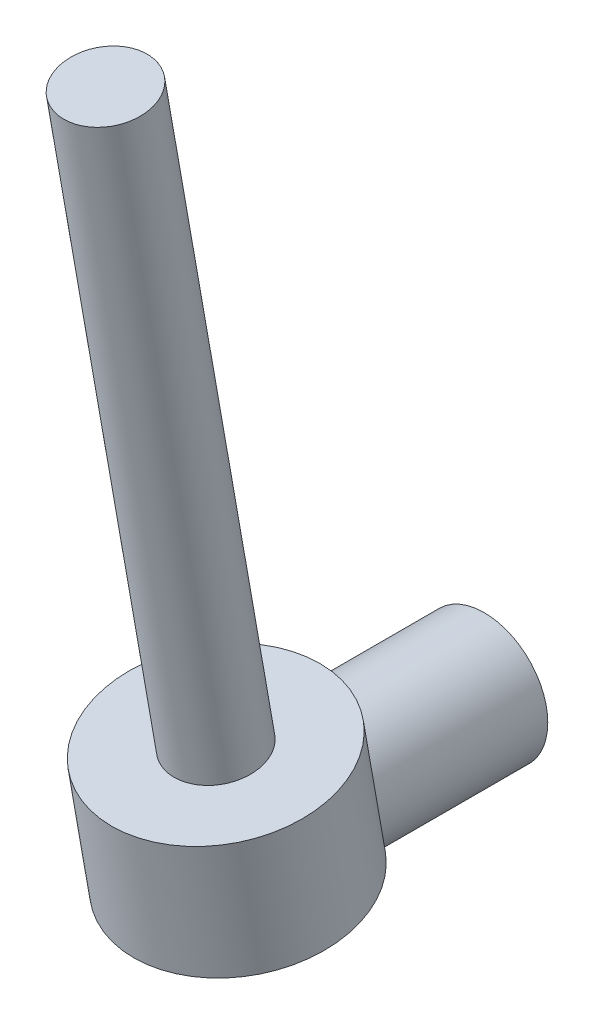
ISO-10303-21;
HEADER;
FILE_DESCRIPTION(('STEP AP214'),'2;1');
FILE_NAME('part.step','',(''),(''),'','','');
FILE_SCHEMA(('AUTOMOTIVE_DESIGN { 1 0 10303 214 1 1 1 1 }'));
ENDSEC;
DATA;
#1=APPLICATION_CONTEXT('core data for automotive mechanical design processes');
#2=APPLICATION_PROTOCOL_DEFINITION('international standard','automotive_design',2000,#1);
#3=PRODUCT_CONTEXT('',#1,'mechanical');
#4=PRODUCT('Part','Part','',(#3));
#5=PRODUCT_RELATED_PRODUCT_CATEGORY('part','',(#4));
#6=PRODUCT_DEFINITION_FORMATION('','',#4);
#7=PRODUCT_DEFINITION_CONTEXT('part definition',#1,'design');
#8=PRODUCT_DEFINITION('design','',#6,#7);
#9=PRODUCT_DEFINITION_SHAPE('','',#8);
#10=(LENGTH_UNIT() NAMED_UNIT(*) SI_UNIT(.MILLI.,.METRE.));
#11=(NAMED_UNIT(*) PLANE_ANGLE_UNIT() SI_UNIT($,.RADIAN.));
#12=(NAMED_UNIT(*) SI_UNIT($,.STERADIAN.) SOLID_ANGLE_UNIT());
#13=UNCERTAINTY_MEASURE_WITH_UNIT(LENGTH_MEASURE(1.E-05),#10,'distance_accuracy_value','');
#14=(GEOMETRIC_REPRESENTATION_CONTEXT(3) GLOBAL_UNCERTAINTY_ASSIGNED_CONTEXT((#13)) GLOBAL_UNIT_ASSIGNED_CONTEXT((#10,
#11,#12)) REPRESENTATION_CONTEXT('',''));
#15=CARTESIAN_POINT('',(0.,0.,0.));
#16=DIRECTION('',(0.,0.,1.));
#17=DIRECTION('',(1.,0.,0.));
#18=AXIS2_PLACEMENT_3D('',#15,#16,#17);
#19=CARTESIAN_POINT('',(0.,0.,-120.));
#20=DIRECTION('',(0.,0.,1.));
#21=DIRECTION('',(1.,0.,0.));
#22=AXIS2_PLACEMENT_3D('',#19,#20,#21);
#23=CYLINDRICAL_SURFACE('',#22,30.);
#24=CARTESIAN_POINT('',(0.,0.,-120.));
#25=DIRECTION('',(0.,0.,1.));
#26=DIRECTION('',(1.,0.,0.));
#27=AXIS2_PLACEMENT_3D('',#24,#25,#26);
#28=CIRCLE('',#27,30.);
#29=CARTESIAN_POINT('',(30.,0.,-120.));
#30=VERTEX_POINT('',#29);
#31=EDGE_CURVE('E81',#30,#30,#28,.T.);
#32=ORIENTED_EDGE('',*,*,#31,.T.);
#33=EDGE_LOOP('',(#32));
#34=FACE_BOUND('',#33,.T.);
#35=CARTESIAN_POINT('',(0.,0.,0.));
#36=DIRECTION('',(0.,0.,1.));
#37=DIRECTION('',(1.,0.,0.));
#38=AXIS2_PLACEMENT_3D('',#35,#36,#37);
#39=CIRCLE('',#38,30.);
#40=CARTESIAN_POINT('',(-22.0808405263408,-20.3085322377149,0.));
#41=VERTEX_POINT('',#40);
#42=CARTESIAN_POINT('',(22.0808405263408,-20.3085322377149,0.));
#43=VERTEX_POINT('',#42);
#44=EDGE_CURVE('E84',#41,#43,#39,.T.);
#45=ORIENTED_EDGE('',*,*,#44,.F.);
#46=CARTESIAN_POINT('',(0.,0.,-115.175409662872));
#47=DIRECTION('',(0.,0.984807753012208,0.173648177666931));
#48=DIRECTION('',(0.,-0.173648177666931,0.984807753012208));
#49=AXIS2_PLACEMENT_3D('',#46,#47,#48);
#50=ELLIPSE('',#49,172.763114494309,30.);
#51=CARTESIAN_POINT('',(-27.3069645861699,-12.4229499350865,-44.7213595499958));
#52=VERTEX_POINT('',#51);
#53=EDGE_CURVE('E57',#41,#52,#50,.F.);
#54=ORIENTED_EDGE('',*,*,#53,.T.);
#55=CARTESIAN_POINT('',(30.,0.,-40.6170644754298));
#56=CARTESIAN_POINT('',(29.9999939235079,0.707543197883763,-40.4923152050487));
#57=CARTESIAN_POINT('',(29.9749284704545,1.41856060044513,-40.386067317288));
#58=CARTESIAN_POINT('',(29.8736135129161,2.84195847361725,-40.2119358912682));
#59=CARTESIAN_POINT('',(29.7973365210962,3.5543394712624,-40.1440729918677));
#60=CARTESIAN_POINT('',(29.5932338685877,4.97561657255136,-40.0464557387305));
#61=CARTESIAN_POINT('',(29.4653174570509,5.68450430553723,-40.016768861775));
#62=CARTESIAN_POINT('',(29.1586506083701,7.09165976099121,-39.9939831732808));
#63=CARTESIAN_POINT('',(28.9799061430948,7.78992872092837,-40.0008800651368));
#64=CARTESIAN_POINT('',(28.5739425857438,9.16750348158058,-40.0480857790182));
#65=CARTESIAN_POINT('',(28.3469511564745,9.84688196170807,-40.0882401609473));
#66=CARTESIAN_POINT('',(27.8458883478011,11.1855878992509,-40.1978234093419));
#67=CARTESIAN_POINT('',(27.5718150427702,11.8449145352565,-40.2672534733382));
#68=CARTESIAN_POINT('',(26.9787450878422,13.1398085860403,-40.4308987762357));
#69=CARTESIAN_POINT('',(26.6597463671865,13.7753749039183,-40.525115157793));
#70=CARTESIAN_POINT('',(25.9789773270823,15.0198463634032,-40.7336454090197));
#71=CARTESIAN_POINT('',(25.6172021300359,15.6287484537468,-40.8479615712966));
#72=CARTESIAN_POINT('',(25.0318069474981,16.5393535429853,-41.0349167917111));
#73=CARTESIAN_POINT('',(24.8226567113378,16.851607063333,-41.1020589427208));
#74=CARTESIAN_POINT('',(24.3932342815186,17.4674266321124,-41.240001790708));
#75=CARTESIAN_POINT('',(24.1729646987265,17.770994693937,-41.3108016289364));
#76=CARTESIAN_POINT('',(23.4958183505138,18.6683719882405,-41.527711137127));
#77=CARTESIAN_POINT('',(23.0225883416242,19.248878638804,-41.6783358856961));
#78=CARTESIAN_POINT('',(22.0349227873433,20.3720841343735,-41.9864646698978));
#79=CARTESIAN_POINT('',(21.5204696967012,20.9147666950832,-42.1439716216062));
#80=CARTESIAN_POINT('',(20.4528031180317,21.9599854233842,-42.4610206807966));
#81=CARTESIAN_POINT('',(19.89958711314,22.4625189795705,-42.6205629198781));
#82=CARTESIAN_POINT('',(18.6786929499943,23.4910086186959,-42.9588359488582));
#83=CARTESIAN_POINT('',(18.0057004148524,24.0107921770194,-43.137211980889));
#84=CARTESIAN_POINT('',(16.6163640393202,24.9923980552272,-43.4847672375343));
#85=CARTESIAN_POINT('',(15.9000164755707,25.4542153864337,-43.6539456698775));
#86=CARTESIAN_POINT('',(14.428072519768,26.3165004486111,-43.9776042729884));
#87=CARTESIAN_POINT('',(13.6724754125551,26.716967061195,-44.1320841757912));
#88=CARTESIAN_POINT('',(12.1267468817253,27.453136584817,-44.4214018152432));
#89=CARTESIAN_POINT('',(11.3366171067298,27.7888425834529,-44.5562404882539));
#90=CARTESIAN_POINT('',(9.73697031516427,28.3885908211911,-44.8004843373788));
#91=CARTESIAN_POINT('',(8.92780667314435,28.6534561554499,-44.9101793014815));
#92=CARTESIAN_POINT('',(7.286870659457,29.1140454263191,-45.1027632954661));
#93=CARTESIAN_POINT('',(6.455098222935,29.3097691645706,-45.1856522484446));
#94=CARTESIAN_POINT('',(4.7759414677009,29.6297230936906,-45.3219433766317));
#95=CARTESIAN_POINT('',(3.92856508709102,29.753988653739,-45.3753601389632));
#96=CARTESIAN_POINT('',(2.22493161205021,29.9296311962083,-45.4510379372651));
#97=CARTESIAN_POINT('',(1.36867515811585,29.9810133991887,-45.4733012047267));
#98=CARTESIAN_POINT('',(-0.278981992251763,30.0091269273242,-45.485472831757));
#99=CARTESIAN_POINT('',(-1.07027786790904,29.9913235097557,-45.4777499625267));
#100=CARTESIAN_POINT('',(-2.64823764937512,29.8933376511472,-45.4354021132333));
#101=CARTESIAN_POINT('',(-3.4349018197654,29.8131588087668,-45.400778685159));
#102=CARTESIAN_POINT('',(-4.99785907115844,29.5912900464081,-45.3055889226213));
#103=CARTESIAN_POINT('',(-5.7741525792564,29.4496026676368,-45.2450236599384));
#104=CARTESIAN_POINT('',(-7.31100800345433,29.1061705108113,-45.0996075397457));
#105=CARTESIAN_POINT('',(-8.0715696562879,28.9044247285715,-45.0147562761712));
#106=CARTESIAN_POINT('',(-9.56401030196719,28.44526042735,-44.8240781375093));
#107=CARTESIAN_POINT('',(-10.2961077964472,28.1884543360402,-44.7184829966646));
#108=CARTESIAN_POINT('',(-11.7356658873733,27.6201556479415,-44.4885244466714));
#109=CARTESIAN_POINT('',(-12.4431268717751,27.3086639127646,-44.3641613332304));
#110=CARTESIAN_POINT('',(-13.8297003107299,26.6333285598536,-44.099863731297));
#111=CARTESIAN_POINT('',(-14.5088078379564,26.2694758911732,-43.9599265516702));
#112=CARTESIAN_POINT('',(-15.8351767947324,25.4919247527341,-43.6681272612077));
#113=CARTESIAN_POINT('',(-16.4824366368741,25.0782238018879,-43.5162645569365));
#114=CARTESIAN_POINT('',(-17.7858271684698,24.1730597048052,-43.1937947085403));
#115=CARTESIAN_POINT('',(-18.4394547168338,23.6781920580798,-43.0226181644514));
#116=CARTESIAN_POINT('',(-19.7034939531367,22.6371991932963,-42.6765552970922));
#117=CARTESIAN_POINT('',(-20.3139037267785,22.0910717072131,-42.5016688099383));
#118=CARTESIAN_POINT('',(-21.4889011322375,20.9499030312052,-42.1538641406265));
#119=CARTESIAN_POINT('',(-22.0534467909966,20.3548180175048,-41.9809478832197));
#120=CARTESIAN_POINT('',(-23.1330159415974,19.1190161732346,-41.6435893344168));
#121=CARTESIAN_POINT('',(-23.6480379859312,18.4782980098221,-41.4791472907756));
#122=CARTESIAN_POINT('',(-24.6503430108225,17.1204119207405,-41.1575718592133));
#123=CARTESIAN_POINT('',(-25.1348672559118,16.401010949303,-41.0012402678032));
#124=CARTESIAN_POINT('',(-26.0417978187261,14.9190936454964,-40.7139676071909));
#125=CARTESIAN_POINT('',(-26.4642004815186,14.156574779931,-40.5830280317875));
#126=CARTESIAN_POINT('',(-27.2422047507394,12.594538074992,-40.3554742206554));
#127=CARTESIAN_POINT('',(-27.5979008549596,11.7950746055036,-40.2588112523078));
#128=CARTESIAN_POINT('',(-28.2391194899562,10.1645965936613,-40.108075170663));
#129=CARTESIAN_POINT('',(-28.5246559378761,9.33358834647158,-40.0539936060527));
#130=CARTESIAN_POINT('',(-28.9958999217448,7.73668236593174,-39.9988642294013));
#131=CARTESIAN_POINT('',(-29.1889447720791,6.97311901093514,-39.9928406522561));
#132=CARTESIAN_POINT('',(-29.5142281310543,5.4340358257824,-40.0247185723327));
#133=CARTESIAN_POINT('',(-29.6464720027143,4.65851705640617,-40.0626161943968));
#134=CARTESIAN_POINT('',(-29.849329889886,3.10354177493019,-40.1843254380696));
#135=CARTESIAN_POINT('',(-29.9199826700478,2.32408805063839,-40.2681081260494));
#136=CARTESIAN_POINT('',(-30.0002713140572,0.768348284037337,-40.4814100181536));
#137=CARTESIAN_POINT('',(-30.0099098635061,-0.00793789619138907,-40.6109272089639));
#138=CARTESIAN_POINT('',(-29.9723841541808,-1.4528220625164,-40.8942549545247));
#139=CARTESIAN_POINT('',(-29.9322427300522,-2.12263410157824,-41.0429287317774));
#140=CARTESIAN_POINT('',(-29.8083620027309,-3.45052892960559,-41.3707812627616));
#141=CARTESIAN_POINT('',(-29.7246282410847,-4.10861319843435,-41.5499561371837));
#142=CARTESIAN_POINT('',(-29.5154632456559,-5.4103973040911,-41.9356687379801));
#143=CARTESIAN_POINT('',(-29.3900037662695,-6.05408708091081,-42.1422249426187));
#144=CARTESIAN_POINT('',(-29.0994707669257,-7.32430478348023,-42.5789333441055));
#145=CARTESIAN_POINT('',(-28.9343907246775,-7.95082986465843,-42.8090894223606));
#146=CARTESIAN_POINT('',(-28.4966324669653,-9.41976443772,-43.3805158859028));
#147=CARTESIAN_POINT('',(-28.2069107241734,-10.2536493616826,-43.7307529946187));
#148=CARTESIAN_POINT('',(-27.5604043275437,-11.8824427106357,-44.4590030745173));
#149=CARTESIAN_POINT('',(-27.2035974600944,-12.6773381149475,-44.8370252207157));
#150=CARTESIAN_POINT('',(-26.4260417583763,-14.2273417583467,-45.6120203327511));
#151=CARTESIAN_POINT('',(-26.0051916007722,-14.9823843504803,-46.0090226322784));
#152=CARTESIAN_POINT('',(-25.1027800588982,-16.4496889637731,-46.8126003562981));
#153=CARTESIAN_POINT('',(-24.6212241757927,-17.1619548527412,-47.2191749106395));
#154=CARTESIAN_POINT('',(-23.5919803889969,-18.5520067685162,-48.0395399729093));
#155=CARTESIAN_POINT('',(-23.0434449555166,-19.2291537517412,-48.453350501962));
#156=CARTESIAN_POINT('',(-21.8872719710585,-20.5355375771342,-49.2741497821856));
#157=CARTESIAN_POINT('',(-21.2796297143807,-21.1647705975833,-49.6811379871785));
#158=CARTESIAN_POINT('',(-20.0070712821806,-22.3715168270903,-50.4796587478783));
#159=CARTESIAN_POINT('',(-19.3422269566648,-22.949093112487,-50.8712098172527));
#160=CARTESIAN_POINT('',(-18.3028567223324,-23.7739568335127,-51.4409253720186));
#161=CARTESIAN_POINT('',(-17.9494023750234,-24.0419816226232,-51.6278860159088));
#162=CARTESIAN_POINT('',(-17.2284923550794,-24.5637353495083,-51.994982486192));
#163=CARTESIAN_POINT('',(-16.861033160956,-24.8174606514208,-52.1751165730492));
#164=CARTESIAN_POINT('',(-15.8790458791,-25.4634022334947,-52.6372781753408));
#165=CARTESIAN_POINT('',(-15.2532919222919,-25.8433557933182,-52.9128255703799));
#166=CARTESIAN_POINT('',(-13.9674838129413,-26.5603298161732,-53.4381760568103));
#167=CARTESIAN_POINT('',(-13.3074367952623,-26.8973591598656,-53.687984471332));
#168=CARTESIAN_POINT('',(-11.9554132378218,-27.5249561938384,-54.1570957465709));
#169=CARTESIAN_POINT('',(-11.2634491842734,-27.8155418579283,-54.376410404147));
#170=CARTESIAN_POINT('',(-9.85058680209408,-28.3467006575377,-54.7799665690819));
#171=CARTESIAN_POINT('',(-9.12968817547232,-28.587273277826,-54.964207715114));
#172=CARTESIAN_POINT('',(-7.65715575236786,-29.0165626153199,-55.2946135502608));
#173=CARTESIAN_POINT('',(-6.90531536788091,-29.2048289279707,-55.4404469879132));
#174=CARTESIAN_POINT('',(-5.3822779128157,-29.5234866563288,-55.6881145275245));
#175=CARTESIAN_POINT('',(-4.61108078612727,-29.6538779042509,-55.7899485019249));
#176=CARTESIAN_POINT('',(-3.05665129865574,-29.8541542007076,-55.9466387169696));
#177=CARTESIAN_POINT('',(-2.27342754753279,-29.9240806516703,-56.001527102672));
#178=CARTESIAN_POINT('',(-0.702057243437365,-30.0020946836075,-56.0627752478859));
#179=CARTESIAN_POINT('',(0.08608865598874,-30.0101903066215,-56.0691413184622));
#180=CARTESIAN_POINT('',(1.55485379333076,-29.9674566642024,-56.0355799754251));
#181=CARTESIAN_POINT('',(2.23585455339579,-29.9243089604059,-56.0016873659754));
#182=CARTESIAN_POINT('',(3.59057124338191,-29.7921273235599,-55.8980915663266));
#183=CARTESIAN_POINT('',(4.26428793144068,-29.7030982137863,-55.8283921403162));
#184=CARTESIAN_POINT('',(5.59985965153252,-29.4805024925109,-55.654714892245));
#185=CARTESIAN_POINT('',(6.26171349971872,-29.346931461758,-55.5507336689085));
#186=CARTESIAN_POINT('',(7.56940382960917,-29.0371433654412,-55.3106705949103));
#187=CARTESIAN_POINT('',(8.21523960195944,-28.860924414936,-55.1745873254176));
#188=CARTESIAN_POINT('',(9.49005586006256,-28.467275633587,-54.8723429864446));
#189=CARTESIAN_POINT('',(10.1189546292867,-28.2496766610699,-54.7060585992034));
#190=CARTESIAN_POINT('',(11.3542499063967,-27.7762234831301,-54.3467947336544));
#191=CARTESIAN_POINT('',(11.9606466528085,-27.520369683361,-54.1538155384195));
#192=CARTESIAN_POINT('',(13.1488510606105,-26.9728695729053,-53.7442963240748));
#193=CARTESIAN_POINT('',(13.7306560906733,-26.6812194449601,-53.5277537924912));
#194=CARTESIAN_POINT('',(14.8680701368549,-26.0645183751586,-53.0743143357793));
#195=CARTESIAN_POINT('',(15.4236756348376,-25.7394629660884,-52.8374146890352));
#196=CARTESIAN_POINT('',(16.5953110537789,-25.0029772943042,-52.3066770232469));
#197=CARTESIAN_POINT('',(17.2065489203368,-24.5860849802975,-52.0098320994073));
#198=CARTESIAN_POINT('',(18.3907926197529,-23.71328639554,-51.3978692759225));
#199=CARTESIAN_POINT('',(18.9637950826736,-23.257376693992,-51.082749770181));
#200=CARTESIAN_POINT('',(20.0712224904164,-22.3087006406871,-50.4387020230854));
#201=CARTESIAN_POINT('',(20.605610674169,-21.8159000538764,-50.1097610826597));
#202=CARTESIAN_POINT('',(21.6345501701607,-20.795938815753,-49.4430157181726));
#203=CARTESIAN_POINT('',(22.1290994415872,-20.2687764067001,-49.1052108412153));
#204=CARTESIAN_POINT('',(23.1757340282225,-19.0694277071393,-48.3551006615324));
#205=CARTESIAN_POINT('',(23.7186009701401,-18.3897787651533,-47.9418205995649));
#206=CARTESIAN_POINT('',(24.7439928083311,-16.9850287157812,-47.1172611820617));
#207=CARTESIAN_POINT('',(25.2265054784713,-16.2599184436835,-46.705982248065));
#208=CARTESIAN_POINT('',(26.1291751964738,-14.7657815890614,-45.8939344533509));
#209=CARTESIAN_POINT('',(26.5493091320489,-13.9967388743043,-45.4931695332933));
#210=CARTESIAN_POINT('',(27.3239550424738,-12.4167313130785,-44.7115731025166));
#211=CARTESIAN_POINT('',(27.6784853433193,-11.6057782552445,-44.330736046449));
#212=CARTESIAN_POINT('',(28.2598792865491,-10.0950410984705,-43.6653478245377));
#213=CARTESIAN_POINT('',(28.4982351464794,-9.4018366329193,-43.3758760697319));
#214=CARTESIAN_POINT('',(28.9257515083544,-7.99028102547091,-42.8224908338236));
#215=CARTESIAN_POINT('',(29.1149081159082,-7.27192789802232,-42.5585793769958));
#216=CARTESIAN_POINT('',(29.4404029075628,-5.81530088793311,-42.0629903510174));
#217=CARTESIAN_POINT('',(29.576920290324,-5.07710390874804,-41.8312051728399));
#218=CARTESIAN_POINT('',(29.7948865121952,-3.58248949594673,-41.4043663962857));
#219=CARTESIAN_POINT('',(29.8763735138266,-2.82608506662177,-41.2092874107272));
#220=CARTESIAN_POINT('',(29.9525137272851,-1.72169644799017,-40.9567739465914));
#221=CARTESIAN_POINT('',(29.9702685881638,-1.37890426612202,-40.8828302981896));
#222=CARTESIAN_POINT('',(29.9940159340076,-0.691018866627258,-40.7434691390379));
#223=CARTESIAN_POINT('',(30.0000029708553,-0.34592465738614,-40.6780555905234));
#224=CARTESIAN_POINT('',(30.,0.,-40.6170644754298));
#225=B_SPLINE_CURVE_WITH_KNOTS('',3,(#55,#56,#57,#58,#59,#60,#61,#62,#63,#64,#65,#66,#67,#68,
#69,#70,#71,#72,#73,#74,#75,#76,#77,#78,#79,#80,#81,#82,#83,#84,#85,#86,#87,#88,#89,#90,#91,#92,
#93,#94,#95,#96,#97,#98,#99,#100,#101,#102,#103,#104,#105,#106,#107,#108,#109,#110,#111,#112,
#113,#114,#115,#116,#117,#118,#119,#120,#121,#122,#123,#124,#125,#126,#127,#128,#129,#130,#131,
#132,#133,#134,#135,#136,#137,#138,#139,#140,#141,#142,#143,#144,#145,#146,#147,#148,#149,#150,
#151,#152,#153,#154,#155,#156,#157,#158,#159,#160,#161,#162,#163,#164,#165,#166,#167,#168,#169,
#170,#171,#172,#173,#174,#175,#176,#177,#178,#179,#180,#181,#182,#183,#184,#185,#186,#187,#188,
#189,#190,#191,#192,#193,#194,#195,#196,#197,#198,#199,#200,#201,#202,#203,#204,#205,#206,#207,
#208,#209,#210,#211,#212,#213,#214,#215,#216,#217,#218,#219,#220,#221,#222,#223,#224),
.UNSPECIFIED.,.T.,.F.,(4,2,2,2,2,2,2,2,2,2,2,2,2,2,2,2,2,2,2,2,2,2,2,2,2,2,2,2,2,2,2,2,2,2,2,2,
2,2,2,2,2,2,2,2,2,2,2,2,2,2,2,2,2,2,2,2,2,2,2,2,2,2,2,2,2,2,2,2,2,2,2,2,2,2,2,2,2,2,2,2,2,2,2,2,
4),(0.,2.15501124958965,4.31118010785963,6.47115481725114,8.6308758525778,10.7806235077636,
12.9304591075737,15.0803938327654,17.2305739416131,18.3756621961425,19.5204828187925,
21.8100362375701,24.1005693590329,26.3912513421759,28.9947396140629,31.5984517934293,
34.2022114312672,36.8058468987156,39.3777687181982,41.9496979161583,44.5203530052411,
47.0908239516552,49.4625293656505,51.8340979576944,54.205568578409,56.5770788526956,
58.9234658140308,61.2698158096497,63.6165718762138,65.9634447956341,68.4732295731777,
70.9831254501864,73.4952930011256,76.0075339569963,78.6480390761489,81.2886994877072,
83.92559035501,86.5619577353025,88.9212869915836,91.2804081006097,93.6380433345573,
95.9955747941507,98.0552463449109,100.114656129953,102.175462848981,104.23660904857,
107.081706270957,109.927747242749,112.778338690298,115.628672002155,118.519782243256,
121.411122844392,124.298883297083,125.742611730714,127.18670561328,129.530993633916,
131.874795850359,134.217688802136,136.560605889056,138.923112936022,141.285626832072,
143.646521745668,146.007109583746,148.054248379586,150.101172014154,152.148298795826,
154.19551607239,156.251288613247,158.307039356274,160.36300951179,162.41925496627,
164.808603591289,167.198162527918,169.589967161704,171.981894241727,174.86793148159,
177.754552410496,180.642240222344,183.529120153537,185.891367386199,188.253801546826,
190.608120779256,192.960805654946,194.013923884807,195.067529559213),.UNSPECIFIED.);
#226=CARTESIAN_POINT('',(27.3069645861699,-12.4229499350865,-44.7213595499958));
#227=VERTEX_POINT('',#226);
#228=EDGE_CURVE('E41',#227,#52,#225,.T.);
#229=ORIENTED_EDGE('',*,*,#228,.F.);
#230=EDGE_CURVE('E67',#227,#43,#50,.F.);
#231=ORIENTED_EDGE('',*,*,#230,.T.);
#232=EDGE_LOOP('',(#45,#54,#229,#231));
#233=FACE_BOUND('',#232,.T.);
#234=ADVANCED_FACE('F37',(#34,#233),#23,.T.);
#235=CARTESIAN_POINT('',(0.,0.,0.));
#236=DIRECTION('',(0.,0.,1.));
#237=DIRECTION('',(1.,0.,0.));
#238=AXIS2_PLACEMENT_3D('',#235,#236,#237);
#239=PLANE('',#238);
#240=ORIENTED_EDGE('',*,*,#44,.T.);
#241=DIRECTION('',(-1.,0.,0.));
#242=VECTOR('',#241,1.);
#243=CARTESIAN_POINT('',(0.,-20.3085322377149,0.));
#244=LINE('',#243,#242);
#245=EDGE_CURVE('E61',#43,#41,#244,.T.);
#246=ORIENTED_EDGE('',*,*,#245,.T.);
#247=EDGE_LOOP('',(#240,#246));
#248=FACE_BOUND('',#247,.T.);
#249=ADVANCED_FACE('F114',(#248),#239,.T.);
#250=CARTESIAN_POINT('',(0.,0.,-120.));
#251=DIRECTION('',(0.,0.,1.));
#252=DIRECTION('',(1.,0.,0.));
#253=AXIS2_PLACEMENT_3D('',#250,#251,#252);
#254=PLANE('',#253);
#255=ORIENTED_EDGE('',*,*,#31,.F.);
#256=EDGE_LOOP('',(#255));
#257=FACE_BOUND('',#256,.T.);
#258=ADVANCED_FACE('F108',(#257),#254,.F.);
#259=CARTESIAN_POINT('',(0.,-19.6961550602442,-3.47296355333861));
#260=DIRECTION('',(0.,0.984807753012208,0.173648177666931));
#261=DIRECTION('',(0.,-0.173648177666931,0.984807753012208));
#262=AXIS2_PLACEMENT_3D('',#259,#260,#261);
#263=CYLINDRICAL_SURFACE('',#262,50.);
#264=CARTESIAN_POINT('',(0.,-19.6961550602442,-3.47296355333861));
#265=DIRECTION('',(0.,0.984807753012208,0.173648177666931));
#266=DIRECTION('',(0.,-0.173648177666931,0.984807753012208));
#267=AXIS2_PLACEMENT_3D('',#264,#265,#266);
#268=CIRCLE('',#267,50.);
#269=EDGE_CURVE('E70',#52,#227,#268,.T.);
#270=ORIENTED_EDGE('',*,*,#269,.T.);
#271=ORIENTED_EDGE('',*,*,#228,.T.);
#272=EDGE_LOOP('',(#270,#271));
#273=FACE_BOUND('',#272,.T.);
#274=CARTESIAN_POINT('',(0.,39.3923101204883,6.94592710667723));
#275=DIRECTION('',(0.,0.984807753012208,0.173648177666931));
#276=DIRECTION('',(0.,-0.173648177666931,0.984807753012208));
#277=AXIS2_PLACEMENT_3D('',#274,#275,#276);
#278=CIRCLE('',#277,50.);
#279=CARTESIAN_POINT('',(0.,30.7099012371418,56.1863147572876));
#280=VERTEX_POINT('',#279);
#281=EDGE_CURVE('E79',#280,#280,#278,.T.);
#282=ORIENTED_EDGE('',*,*,#281,.F.);
#283=EDGE_LOOP('',(#282));
#284=FACE_BOUND('',#283,.T.);
#285=ADVANCED_FACE('F77',(#273,#284),#263,.T.);
#286=CARTESIAN_POINT('',(0.,-19.6961550602442,-3.47296355333861));
#287=DIRECTION('',(0.,0.984807753012208,0.173648177666931));
#288=DIRECTION('',(0.,-0.173648177666931,0.984807753012208));
#289=AXIS2_PLACEMENT_3D('',#286,#287,#288);
#290=PLANE('',#289);
#291=ORIENTED_EDGE('',*,*,#53,.F.);
#292=ORIENTED_EDGE('',*,*,#245,.F.);
#293=ORIENTED_EDGE('',*,*,#230,.F.);
#294=ORIENTED_EDGE('',*,*,#269,.F.);
#295=EDGE_LOOP('',(#291,#292,#293,#294));
#296=FACE_BOUND('',#295,.T.);
#297=ADVANCED_FACE('F69',(#296),#290,.F.);
#298=CARTESIAN_POINT('',(0.,39.3923101204883,6.94592710667723));
#299=DIRECTION('',(0.,0.984807753012208,0.173648177666931));
#300=DIRECTION('',(0.,-0.173648177666931,0.984807753012208));
#301=AXIS2_PLACEMENT_3D('',#298,#299,#300);
#302=PLANE('',#301);
#303=CARTESIAN_POINT('',(0.,39.3923101204883,6.94592710667723));
#304=DIRECTION('',(0.,0.984807753012208,0.173648177666931));
#305=DIRECTION('',(0.,-0.173648177666931,0.984807753012208));
#306=AXIS2_PLACEMENT_3D('',#303,#304,#305);
#307=CIRCLE('',#306,20.);
#308=CARTESIAN_POINT('',(0.,35.9193465671497,26.6420821669214));
#309=VERTEX_POINT('',#308);
#310=EDGE_CURVE('E11',#309,#309,#307,.T.);
#311=ORIENTED_EDGE('',*,*,#310,.F.);
#312=EDGE_LOOP('',(#311));
#313=FACE_BOUND('',#312,.T.);
#314=ORIENTED_EDGE('',*,*,#281,.T.);
#315=EDGE_LOOP('',(#314));
#316=FACE_BOUND('',#315,.T.);
#317=ADVANCED_FACE('F99',(#313,#316),#302,.T.);
#318=CARTESIAN_POINT('',(0.,334.834636024151,59.0403804067565));
#319=DIRECTION('',(0.,-0.984807753012208,-0.173648177666931));
#320=DIRECTION('',(0.,0.173648177666931,-0.984807753012208));
#321=AXIS2_PLACEMENT_3D('',#318,#319,#320);
#322=CYLINDRICAL_SURFACE('',#321,20.);
#323=CARTESIAN_POINT('',(0.,334.834636024151,59.0403804067565));
#324=DIRECTION('',(0.,0.984807753012208,0.173648177666931));
#325=DIRECTION('',(0.,-0.173648177666931,0.984807753012208));
#326=AXIS2_PLACEMENT_3D('',#323,#324,#325);
#327=CIRCLE('',#326,20.);
#328=CARTESIAN_POINT('',(0.,331.361672470812,78.7365354670006));
#329=VERTEX_POINT('',#328);
#330=EDGE_CURVE('E89',#329,#329,#327,.T.);
#331=ORIENTED_EDGE('',*,*,#330,.F.);
#332=EDGE_LOOP('',(#331));
#333=FACE_BOUND('',#332,.T.);
#334=ORIENTED_EDGE('',*,*,#310,.T.);
#335=EDGE_LOOP('',(#334));
#336=FACE_BOUND('',#335,.T.);
#337=ADVANCED_FACE('F96',(#333,#336),#322,.T.);
#338=CARTESIAN_POINT('',(0.,334.834636024151,59.0403804067565));
#339=DIRECTION('',(0.,0.984807753012208,0.173648177666931));
#340=DIRECTION('',(0.,-0.173648177666931,0.984807753012208));
#341=AXIS2_PLACEMENT_3D('',#338,#339,#340);
#342=PLANE('',#341);
#343=ORIENTED_EDGE('',*,*,#330,.T.);
#344=EDGE_LOOP('',(#343));
#345=FACE_BOUND('',#344,.T.);
#346=ADVANCED_FACE('F94',(#345),#342,.T.);
#347=CLOSED_SHELL('',(#234,#249,#258,#285,#297,#317,#337,#346));
#348=MANIFOLD_SOLID_BREP('B2',#347);
#349=ADVANCED_BREP_SHAPE_REPRESENTATION('',(#18,#348),#14);
#350=SHAPE_DEFINITION_REPRESENTATION(#9,#349);
ENDSEC;
END-ISO-10303-21;
